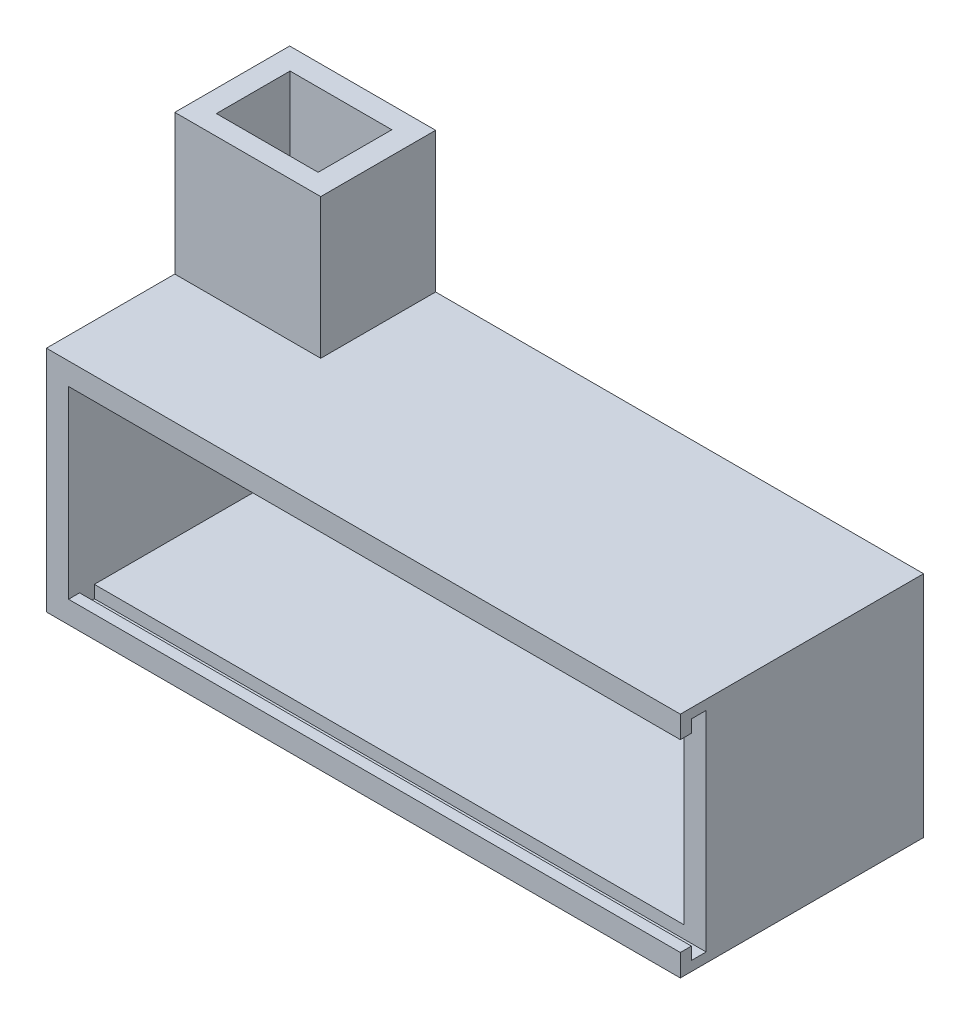
ISO-10303-21;
HEADER;
FILE_DESCRIPTION(('STEP AP214'),'2;1');
FILE_NAME('part.step','',(''),(''),'','','');
FILE_SCHEMA(('AUTOMOTIVE_DESIGN { 1 0 10303 214 1 1 1 1 }'));
ENDSEC;
DATA;
#1=APPLICATION_CONTEXT('core data for automotive mechanical design processes');
#2=APPLICATION_PROTOCOL_DEFINITION('international standard','automotive_design',2000,#1);
#3=PRODUCT_CONTEXT('',#1,'mechanical');
#4=PRODUCT('Part','Part','',(#3));
#5=PRODUCT_RELATED_PRODUCT_CATEGORY('part','',(#4));
#6=PRODUCT_DEFINITION_FORMATION('','',#4);
#7=PRODUCT_DEFINITION_CONTEXT('part definition',#1,'design');
#8=PRODUCT_DEFINITION('design','',#6,#7);
#9=PRODUCT_DEFINITION_SHAPE('','',#8);
#10=(LENGTH_UNIT() NAMED_UNIT(*) SI_UNIT(.MILLI.,.METRE.));
#11=(NAMED_UNIT(*) PLANE_ANGLE_UNIT() SI_UNIT($,.RADIAN.));
#12=(NAMED_UNIT(*) SI_UNIT($,.STERADIAN.) SOLID_ANGLE_UNIT());
#13=UNCERTAINTY_MEASURE_WITH_UNIT(LENGTH_MEASURE(1.E-05),#10,'distance_accuracy_value','');
#14=(GEOMETRIC_REPRESENTATION_CONTEXT(3) GLOBAL_UNCERTAINTY_ASSIGNED_CONTEXT((#13)) GLOBAL_UNIT_ASSIGNED_CONTEXT((#10,
#11,#12)) REPRESENTATION_CONTEXT('',''));
#15=CARTESIAN_POINT('',(0.,0.,0.));
#16=DIRECTION('',(0.,0.,1.));
#17=DIRECTION('',(1.,0.,0.));
#18=AXIS2_PLACEMENT_3D('',#15,#16,#17);
#19=CARTESIAN_POINT('',(0.,28.,28.));
#20=DIRECTION('',(0.,-1.,0.));
#21=DIRECTION('',(1.,0.,0.));
#22=AXIS2_PLACEMENT_3D('',#19,#20,#21);
#23=PLANE('',#22);
#24=DIRECTION('',(0.,0.,-1.));
#25=VECTOR('',#24,1.);
#26=CARTESIAN_POINT('',(-63.1995620838004,28.,15.5864842636624));
#27=LINE('',#26,#25);
#28=CARTESIAN_POINT('',(-63.1995620838004,28.,15.5864842636624));
#29=VERTEX_POINT('',#28);
#30=CARTESIAN_POINT('',(-63.1995620838004,28.,0.));
#31=VERTEX_POINT('',#30);
#32=EDGE_CURVE('E248',#29,#31,#27,.T.);
#33=ORIENTED_EDGE('',*,*,#32,.F.);
#34=DIRECTION('',(1.,0.,0.));
#35=VECTOR('',#34,1.);
#36=CARTESIAN_POINT('',(-83.,28.,15.5864842636624));
#37=LINE('',#36,#35);
#38=CARTESIAN_POINT('',(-83.,28.,15.5864842636624));
#39=VERTEX_POINT('',#38);
#40=EDGE_CURVE('E61',#39,#29,#37,.T.);
#41=ORIENTED_EDGE('',*,*,#40,.F.);
#42=DIRECTION('',(0.,0.,-1.));
#43=VECTOR('',#42,1.);
#44=CARTESIAN_POINT('',(-83.,28.,0.));
#45=LINE('',#44,#43);
#46=CARTESIAN_POINT('',(-83.,28.,33.));
#47=VERTEX_POINT('',#46);
#48=EDGE_CURVE('E354',#47,#39,#45,.T.);
#49=ORIENTED_EDGE('',*,*,#48,.F.);
#50=DIRECTION('',(1.,0.,0.));
#51=VECTOR('',#50,1.);
#52=CARTESIAN_POINT('',(-88.8309518948453,28.,33.));
#53=LINE('',#52,#51);
#54=CARTESIAN_POINT('',(3.,28.,33.));
#55=VERTEX_POINT('',#54);
#56=EDGE_CURVE('E302',#47,#55,#53,.T.);
#57=ORIENTED_EDGE('',*,*,#56,.T.);
#58=DIRECTION('',(0.,0.,1.));
#59=VECTOR('',#58,1.);
#60=CARTESIAN_POINT('',(3.,28.,28.));
#61=LINE('',#60,#59);
#62=CARTESIAN_POINT('',(3.,28.,0.));
#63=VERTEX_POINT('',#62);
#64=EDGE_CURVE('E362',#63,#55,#61,.T.);
#65=ORIENTED_EDGE('',*,*,#64,.F.);
#66=DIRECTION('',(-1.,0.,0.));
#67=VECTOR('',#66,1.);
#68=CARTESIAN_POINT('',(0.,28.,0.));
#69=LINE('',#68,#67);
#70=EDGE_CURVE('E365',#63,#31,#69,.T.);
#71=ORIENTED_EDGE('',*,*,#70,.T.);
#72=EDGE_LOOP('',(#33,#41,#49,#57,#65,#71));
#73=FACE_BOUND('',#72,.T.);
#74=ADVANCED_FACE('F38',(#73),#23,.F.);
#75=CARTESIAN_POINT('',(0.,0.,28.));
#76=DIRECTION('',(0.,1.,0.));
#77=DIRECTION('',(0.,0.,1.));
#78=AXIS2_PLACEMENT_3D('',#75,#76,#77);
#79=PLANE('',#78);
#80=DIRECTION('',(1.,0.,0.));
#81=VECTOR('',#80,1.);
#82=CARTESIAN_POINT('',(-88.8309518948453,0.,29.5));
#83=LINE('',#82,#81);
#84=CARTESIAN_POINT('',(-80.,0.,29.5));
#85=VERTEX_POINT('',#84);
#86=CARTESIAN_POINT('',(0.,0.,29.5));
#87=VERTEX_POINT('',#86);
#88=EDGE_CURVE('E340',#85,#87,#83,.T.);
#89=ORIENTED_EDGE('',*,*,#88,.T.);
#90=DIRECTION('',(0.,0.,-1.));
#91=VECTOR('',#90,1.);
#92=CARTESIAN_POINT('',(0.,0.,28.));
#93=LINE('',#92,#91);
#94=CARTESIAN_POINT('',(0.,0.,4.));
#95=VERTEX_POINT('',#94);
#96=EDGE_CURVE('E376',#87,#95,#93,.T.);
#97=ORIENTED_EDGE('',*,*,#96,.T.);
#98=DIRECTION('',(1.,0.,0.));
#99=VECTOR('',#98,1.);
#100=CARTESIAN_POINT('',(0.,0.,4.));
#101=LINE('',#100,#99);
#102=CARTESIAN_POINT('',(-80.,0.,4.));
#103=VERTEX_POINT('',#102);
#104=EDGE_CURVE('E46',#103,#95,#101,.T.);
#105=ORIENTED_EDGE('',*,*,#104,.F.);
#106=DIRECTION('',(0.,0.,-1.));
#107=VECTOR('',#106,1.);
#108=CARTESIAN_POINT('',(-80.,0.,28.));
#109=LINE('',#108,#107);
#110=EDGE_CURVE('E375',#85,#103,#109,.T.);
#111=ORIENTED_EDGE('',*,*,#110,.F.);
#112=EDGE_LOOP('',(#89,#97,#105,#111));
#113=FACE_BOUND('',#112,.T.);
#114=ADVANCED_FACE('F394',(#113),#79,.T.);
#115=CARTESIAN_POINT('',(0.,25.,28.));
#116=DIRECTION('',(0.,1.,0.));
#117=DIRECTION('',(-1.,0.,0.));
#118=AXIS2_PLACEMENT_3D('',#115,#116,#117);
#119=PLANE('',#118);
#120=DIRECTION('',(1.,0.,0.));
#121=VECTOR('',#120,1.);
#122=CARTESIAN_POINT('',(-80.0315468597901,25.,12.9108154511568));
#123=LINE('',#122,#121);
#124=CARTESIAN_POINT('',(-80.,25.,12.9108154511568));
#125=VERTEX_POINT('',#124);
#126=CARTESIAN_POINT('',(-66.2311089435905,25.,12.9108154511568));
#127=VERTEX_POINT('',#126);
#128=EDGE_CURVE('E214',#125,#127,#123,.T.);
#129=ORIENTED_EDGE('',*,*,#128,.T.);
#130=DIRECTION('',(0.,0.,-1.));
#131=VECTOR('',#130,1.);
#132=CARTESIAN_POINT('',(-66.2311089435905,25.,2.91081545115682));
#133=LINE('',#132,#131);
#134=CARTESIAN_POINT('',(-66.2311089435905,25.,4.));
#135=VERTEX_POINT('',#134);
#136=EDGE_CURVE('E224',#127,#135,#133,.T.);
#137=ORIENTED_EDGE('',*,*,#136,.T.);
#138=DIRECTION('',(-1.,0.,0.));
#139=VECTOR('',#138,1.);
#140=CARTESIAN_POINT('',(0.,25.,4.));
#141=LINE('',#140,#139);
#142=CARTESIAN_POINT('',(0.,25.,4.));
#143=VERTEX_POINT('',#142);
#144=EDGE_CURVE('E383',#143,#135,#141,.T.);
#145=ORIENTED_EDGE('',*,*,#144,.F.);
#146=DIRECTION('',(0.,0.,-1.));
#147=VECTOR('',#146,1.);
#148=CARTESIAN_POINT('',(0.,25.,28.));
#149=LINE('',#148,#147);
#150=CARTESIAN_POINT('',(0.,25.,29.5));
#151=VERTEX_POINT('',#150);
#152=EDGE_CURVE('E367',#151,#143,#149,.T.);
#153=ORIENTED_EDGE('',*,*,#152,.F.);
#154=DIRECTION('',(1.,0.,0.));
#155=VECTOR('',#154,1.);
#156=CARTESIAN_POINT('',(-88.8309518948453,25.,29.5));
#157=LINE('',#156,#155);
#158=CARTESIAN_POINT('',(-80.,25.,29.5));
#159=VERTEX_POINT('',#158);
#160=EDGE_CURVE('E288',#159,#151,#157,.T.);
#161=ORIENTED_EDGE('',*,*,#160,.F.);
#162=DIRECTION('',(0.,0.,-1.));
#163=VECTOR('',#162,1.);
#164=CARTESIAN_POINT('',(-80.,25.,28.));
#165=LINE('',#164,#163);
#166=EDGE_CURVE('E368',#159,#125,#165,.T.);
#167=ORIENTED_EDGE('',*,*,#166,.T.);
#168=EDGE_LOOP('',(#129,#137,#145,#153,#161,#167));
#169=FACE_BOUND('',#168,.T.);
#170=ADVANCED_FACE('F405',(#169),#119,.F.);
#171=DIRECTION('',(1.,0.,0.));
#172=VECTOR('',#171,1.);
#173=CARTESIAN_POINT('',(-88.8309518948453,0.,31.5));
#174=LINE('',#173,#172);
#175=CARTESIAN_POINT('',(-80.,0.,31.5));
#176=VERTEX_POINT('',#175);
#177=CARTESIAN_POINT('',(3.,0.,31.5));
#178=VERTEX_POINT('',#177);
#179=EDGE_CURVE('E329',#176,#178,#174,.T.);
#180=ORIENTED_EDGE('',*,*,#179,.F.);
#181=DIRECTION('',(0.,0.,-1.));
#182=VECTOR('',#181,1.);
#183=CARTESIAN_POINT('',(-80.,0.,33.));
#184=LINE('',#183,#182);
#185=CARTESIAN_POINT('',(-80.,0.,33.));
#186=VERTEX_POINT('',#185);
#187=EDGE_CURVE('E271',#186,#176,#184,.T.);
#188=ORIENTED_EDGE('',*,*,#187,.F.);
#189=DIRECTION('',(1.,0.,0.));
#190=VECTOR('',#189,1.);
#191=CARTESIAN_POINT('',(-88.8309518948453,0.,33.));
#192=LINE('',#191,#190);
#193=CARTESIAN_POINT('',(3.,0.,33.));
#194=VERTEX_POINT('',#193);
#195=EDGE_CURVE('E324',#186,#194,#192,.T.);
#196=ORIENTED_EDGE('',*,*,#195,.T.);
#197=DIRECTION('',(0.,0.,-1.));
#198=VECTOR('',#197,1.);
#199=CARTESIAN_POINT('',(3.,0.,0.));
#200=LINE('',#199,#198);
#201=EDGE_CURVE('E326',#194,#178,#200,.T.);
#202=ORIENTED_EDGE('',*,*,#201,.T.);
#203=EDGE_LOOP('',(#180,#188,#196,#202));
#204=FACE_BOUND('',#203,.T.);
#205=ADVANCED_FACE('F440',(#204),#79,.T.);
#206=DIRECTION('',(0.,0.,1.));
#207=VECTOR('',#206,1.);
#208=CARTESIAN_POINT('',(-80.,25.,33.));
#209=LINE('',#208,#207);
#210=CARTESIAN_POINT('',(-80.,25.,31.5));
#211=VERTEX_POINT('',#210);
#212=CARTESIAN_POINT('',(-80.,25.,33.));
#213=VERTEX_POINT('',#212);
#214=EDGE_CURVE('E270',#211,#213,#209,.T.);
#215=ORIENTED_EDGE('',*,*,#214,.F.);
#216=DIRECTION('',(1.,0.,0.));
#217=VECTOR('',#216,1.);
#218=CARTESIAN_POINT('',(-88.8309518948453,25.,31.5));
#219=LINE('',#218,#217);
#220=CARTESIAN_POINT('',(3.,25.,31.5));
#221=VERTEX_POINT('',#220);
#222=EDGE_CURVE('E308',#211,#221,#219,.T.);
#223=ORIENTED_EDGE('',*,*,#222,.T.);
#224=DIRECTION('',(0.,0.,-1.));
#225=VECTOR('',#224,1.);
#226=CARTESIAN_POINT('',(3.,25.,0.));
#227=LINE('',#226,#225);
#228=CARTESIAN_POINT('',(3.,25.,33.));
#229=VERTEX_POINT('',#228);
#230=EDGE_CURVE('E296',#229,#221,#227,.T.);
#231=ORIENTED_EDGE('',*,*,#230,.F.);
#232=DIRECTION('',(1.,0.,0.));
#233=VECTOR('',#232,1.);
#234=CARTESIAN_POINT('',(-88.8309518948453,25.,33.));
#235=LINE('',#234,#233);
#236=EDGE_CURVE('E310',#213,#229,#235,.T.);
#237=ORIENTED_EDGE('',*,*,#236,.F.);
#238=EDGE_LOOP('',(#215,#223,#231,#237));
#239=FACE_BOUND('',#238,.T.);
#240=ADVANCED_FACE('F430',(#239),#119,.F.);
#241=CARTESIAN_POINT('',(-88.8309518948453,26.6911601611933,0.));
#242=DIRECTION('',(0.,-1.,0.));
#243=DIRECTION('',(1.,0.,0.));
#244=AXIS2_PLACEMENT_3D('',#241,#242,#243);
#245=PLANE('',#244);
#246=DIRECTION('',(1.,0.,0.));
#247=VECTOR('',#246,1.);
#248=CARTESIAN_POINT('',(-88.8309518948453,26.6911601611933,31.5));
#249=LINE('',#248,#247);
#250=CARTESIAN_POINT('',(-80.,26.6911601611933,31.5));
#251=VERTEX_POINT('',#250);
#252=CARTESIAN_POINT('',(3.,26.6911601611933,31.5));
#253=VERTEX_POINT('',#252);
#254=EDGE_CURVE('E306',#251,#253,#249,.T.);
#255=ORIENTED_EDGE('',*,*,#254,.F.);
#256=DIRECTION('',(0.,0.,-1.));
#257=VECTOR('',#256,1.);
#258=CARTESIAN_POINT('',(-80.,26.6911601611933,0.));
#259=LINE('',#258,#257);
#260=CARTESIAN_POINT('',(-80.,26.6911601611933,29.5));
#261=VERTEX_POINT('',#260);
#262=EDGE_CURVE('E282',#251,#261,#259,.T.);
#263=ORIENTED_EDGE('',*,*,#262,.T.);
#264=DIRECTION('',(1.,0.,0.));
#265=VECTOR('',#264,1.);
#266=CARTESIAN_POINT('',(-88.8309518948453,26.6911601611933,29.5));
#267=LINE('',#266,#265);
#268=CARTESIAN_POINT('',(3.,26.6911601611933,29.5));
#269=VERTEX_POINT('',#268);
#270=EDGE_CURVE('E303',#261,#269,#267,.T.);
#271=ORIENTED_EDGE('',*,*,#270,.T.);
#272=DIRECTION('',(0.,0.,-1.));
#273=VECTOR('',#272,1.);
#274=CARTESIAN_POINT('',(3.,26.6911601611933,0.));
#275=LINE('',#274,#273);
#276=EDGE_CURVE('E289',#253,#269,#275,.T.);
#277=ORIENTED_EDGE('',*,*,#276,.F.);
#278=EDGE_LOOP('',(#255,#263,#271,#277));
#279=FACE_BOUND('',#278,.T.);
#280=ADVANCED_FACE('F423',(#279),#245,.T.);
#281=CARTESIAN_POINT('',(-88.8309518948453,25.,31.5));
#282=DIRECTION('',(0.,0.,-1.));
#283=DIRECTION('',(-1.,0.,0.));
#284=AXIS2_PLACEMENT_3D('',#281,#282,#283);
#285=PLANE('',#284);
#286=ORIENTED_EDGE('',*,*,#222,.F.);
#287=DIRECTION('',(0.,1.,0.));
#288=VECTOR('',#287,1.);
#289=CARTESIAN_POINT('',(-80.,25.,31.5));
#290=LINE('',#289,#288);
#291=EDGE_CURVE('E274',#211,#251,#290,.T.);
#292=ORIENTED_EDGE('',*,*,#291,.T.);
#293=ORIENTED_EDGE('',*,*,#254,.T.);
#294=DIRECTION('',(0.,1.,0.));
#295=VECTOR('',#294,1.);
#296=CARTESIAN_POINT('',(3.,25.,31.5));
#297=LINE('',#296,#295);
#298=EDGE_CURVE('E293',#221,#253,#297,.T.);
#299=ORIENTED_EDGE('',*,*,#298,.F.);
#300=EDGE_LOOP('',(#286,#292,#293,#299));
#301=FACE_BOUND('',#300,.T.);
#302=ADVANCED_FACE('F427',(#301),#285,.T.);
#303=CARTESIAN_POINT('',(-88.8309518948453,0.,29.5));
#304=DIRECTION('',(0.,0.,-1.));
#305=DIRECTION('',(-1.,0.,0.));
#306=AXIS2_PLACEMENT_3D('',#303,#304,#305);
#307=PLANE('',#306);
#308=DIRECTION('',(0.,1.,0.));
#309=VECTOR('',#308,1.);
#310=CARTESIAN_POINT('',(-80.,0.,29.5));
#311=LINE('',#310,#309);
#312=CARTESIAN_POINT('',(-80.,-1.69116016119333,29.5));
#313=VERTEX_POINT('',#312);
#314=EDGE_CURVE('E317',#313,#85,#311,.T.);
#315=ORIENTED_EDGE('',*,*,#314,.F.);
#316=DIRECTION('',(1.,0.,0.));
#317=VECTOR('',#316,1.);
#318=CARTESIAN_POINT('',(-88.8309518948453,-1.69116016119333,29.5));
#319=LINE('',#318,#317);
#320=CARTESIAN_POINT('',(3.,-1.69116016119333,29.5));
#321=VERTEX_POINT('',#320);
#322=EDGE_CURVE('E320',#313,#321,#319,.T.);
#323=ORIENTED_EDGE('',*,*,#322,.T.);
#324=DIRECTION('',(0.,1.,0.));
#325=VECTOR('',#324,1.);
#326=CARTESIAN_POINT('',(3.,0.,29.5));
#327=LINE('',#326,#325);
#328=EDGE_CURVE('E338',#321,#269,#327,.T.);
#329=ORIENTED_EDGE('',*,*,#328,.T.);
#330=ORIENTED_EDGE('',*,*,#270,.F.);
#331=DIRECTION('',(0.,-1.,0.));
#332=VECTOR('',#331,1.);
#333=CARTESIAN_POINT('',(-80.,25.,29.5));
#334=LINE('',#333,#332);
#335=EDGE_CURVE('E285',#261,#159,#334,.T.);
#336=ORIENTED_EDGE('',*,*,#335,.T.);
#337=ORIENTED_EDGE('',*,*,#160,.T.);
#338=DIRECTION('',(0.,-1.,0.));
#339=VECTOR('',#338,1.);
#340=CARTESIAN_POINT('',(0.,25.,29.5));
#341=LINE('',#340,#339);
#342=EDGE_CURVE('E267',#151,#87,#341,.T.);
#343=ORIENTED_EDGE('',*,*,#342,.T.);
#344=ORIENTED_EDGE('',*,*,#88,.F.);
#345=EDGE_LOOP('',(#315,#323,#329,#330,#336,#337,#343,#344));
#346=FACE_BOUND('',#345,.T.);
#347=ADVANCED_FACE('F401',(#346),#307,.F.);
#348=CARTESIAN_POINT('',(-88.8309518948453,0.,31.5));
#349=DIRECTION('',(0.,0.,1.));
#350=DIRECTION('',(1.,0.,0.));
#351=AXIS2_PLACEMENT_3D('',#348,#349,#350);
#352=PLANE('',#351);
#353=DIRECTION('',(0.,-1.,0.));
#354=VECTOR('',#353,1.);
#355=CARTESIAN_POINT('',(-80.,0.,31.5));
#356=LINE('',#355,#354);
#357=CARTESIAN_POINT('',(-80.,-1.69116016119333,31.5));
#358=VERTEX_POINT('',#357);
#359=EDGE_CURVE('E292',#176,#358,#356,.T.);
#360=ORIENTED_EDGE('',*,*,#359,.F.);
#361=ORIENTED_EDGE('',*,*,#179,.T.);
#362=DIRECTION('',(0.,-1.,0.));
#363=VECTOR('',#362,1.);
#364=CARTESIAN_POINT('',(3.,0.,31.5));
#365=LINE('',#364,#363);
#366=CARTESIAN_POINT('',(3.,-1.69116016119333,31.5));
#367=VERTEX_POINT('',#366);
#368=EDGE_CURVE('E330',#178,#367,#365,.T.);
#369=ORIENTED_EDGE('',*,*,#368,.T.);
#370=DIRECTION('',(1.,0.,0.));
#371=VECTOR('',#370,1.);
#372=CARTESIAN_POINT('',(-88.8309518948453,-1.69116016119333,31.5));
#373=LINE('',#372,#371);
#374=EDGE_CURVE('E333',#358,#367,#373,.T.);
#375=ORIENTED_EDGE('',*,*,#374,.F.);
#376=EDGE_LOOP('',(#360,#361,#369,#375));
#377=FACE_BOUND('',#376,.T.);
#378=ADVANCED_FACE('F442',(#377),#352,.F.);
#379=CARTESIAN_POINT('',(-88.8309518948453,-1.69116016119333,0.));
#380=DIRECTION('',(0.,-1.,0.));
#381=DIRECTION('',(0.,0.,-1.));
#382=AXIS2_PLACEMENT_3D('',#379,#380,#381);
#383=PLANE('',#382);
#384=DIRECTION('',(0.,0.,-1.));
#385=VECTOR('',#384,1.);
#386=CARTESIAN_POINT('',(-80.,-1.69116016119333,0.));
#387=LINE('',#386,#385);
#388=EDGE_CURVE('E11',#358,#313,#387,.T.);
#389=ORIENTED_EDGE('',*,*,#388,.F.);
#390=ORIENTED_EDGE('',*,*,#374,.T.);
#391=DIRECTION('',(0.,0.,-1.));
#392=VECTOR('',#391,1.);
#393=CARTESIAN_POINT('',(3.,-1.69116016119333,0.));
#394=LINE('',#393,#392);
#395=EDGE_CURVE('E334',#367,#321,#394,.T.);
#396=ORIENTED_EDGE('',*,*,#395,.T.);
#397=ORIENTED_EDGE('',*,*,#322,.F.);
#398=EDGE_LOOP('',(#389,#390,#396,#397));
#399=FACE_BOUND('',#398,.T.);
#400=ADVANCED_FACE('F414',(#399),#383,.F.);
#401=CARTESIAN_POINT('',(0.,0.,4.));
#402=DIRECTION('',(0.,0.,1.));
#403=DIRECTION('',(1.,0.,0.));
#404=AXIS2_PLACEMENT_3D('',#401,#402,#403);
#405=PLANE('',#404);
#406=DIRECTION('',(0.,1.,0.));
#407=VECTOR('',#406,1.);
#408=CARTESIAN_POINT('',(0.,0.,4.));
#409=LINE('',#408,#407);
#410=EDGE_CURVE('E379',#95,#143,#409,.T.);
#411=ORIENTED_EDGE('',*,*,#410,.T.);
#412=ORIENTED_EDGE('',*,*,#144,.T.);
#413=DIRECTION('',(-1.,0.,0.));
#414=VECTOR('',#413,1.);
#415=CARTESIAN_POINT('',(0.,25.,4.));
#416=LINE('',#415,#414);
#417=CARTESIAN_POINT('',(-80.,25.,4.));
#418=VERTEX_POINT('',#417);
#419=EDGE_CURVE('E228',#135,#418,#416,.T.);
#420=ORIENTED_EDGE('',*,*,#419,.T.);
#421=DIRECTION('',(0.,-1.,0.));
#422=VECTOR('',#421,1.);
#423=CARTESIAN_POINT('',(-80.,0.,4.));
#424=LINE('',#423,#422);
#425=EDGE_CURVE('E386',#418,#103,#424,.T.);
#426=ORIENTED_EDGE('',*,*,#425,.T.);
#427=ORIENTED_EDGE('',*,*,#104,.T.);
#428=EDGE_LOOP('',(#411,#412,#420,#426,#427));
#429=FACE_BOUND('',#428,.T.);
#430=ADVANCED_FACE('F391',(#429),#405,.T.);
#431=CARTESIAN_POINT('',(0.,0.,0.));
#432=DIRECTION('',(0.,0.,1.));
#433=DIRECTION('',(1.,0.,0.));
#434=AXIS2_PLACEMENT_3D('',#431,#432,#433);
#435=PLANE('',#434);
#436=ORIENTED_EDGE('',*,*,#70,.F.);
#437=DIRECTION('',(0.,1.,0.));
#438=VECTOR('',#437,1.);
#439=CARTESIAN_POINT('',(3.,28.,0.));
#440=LINE('',#439,#438);
#441=CARTESIAN_POINT('',(3.,-3.,0.));
#442=VERTEX_POINT('',#441);
#443=EDGE_CURVE('E359',#442,#63,#440,.T.);
#444=ORIENTED_EDGE('',*,*,#443,.F.);
#445=DIRECTION('',(-1.,0.,0.));
#446=VECTOR('',#445,1.);
#447=CARTESIAN_POINT('',(0.,-3.,0.));
#448=LINE('',#447,#446);
#449=CARTESIAN_POINT('',(-83.,-3.,0.));
#450=VERTEX_POINT('',#449);
#451=EDGE_CURVE('E371',#442,#450,#448,.T.);
#452=ORIENTED_EDGE('',*,*,#451,.T.);
#453=DIRECTION('',(0.,-1.,0.));
#454=VECTOR('',#453,1.);
#455=CARTESIAN_POINT('',(-83.,28.,0.));
#456=LINE('',#455,#454);
#457=CARTESIAN_POINT('',(-83.,47.,0.));
#458=VERTEX_POINT('',#457);
#459=EDGE_CURVE('E342',#458,#450,#456,.T.);
#460=ORIENTED_EDGE('',*,*,#459,.F.);
#461=DIRECTION('',(-1.,0.,0.));
#462=VECTOR('',#461,1.);
#463=CARTESIAN_POINT('',(-83.,47.,0.));
#464=LINE('',#463,#462);
#465=CARTESIAN_POINT('',(-63.1995620838004,47.,0.));
#466=VERTEX_POINT('',#465);
#467=EDGE_CURVE('E252',#466,#458,#464,.T.);
#468=ORIENTED_EDGE('',*,*,#467,.F.);
#469=DIRECTION('',(0.,-1.,0.));
#470=VECTOR('',#469,1.);
#471=CARTESIAN_POINT('',(-63.1995620838004,47.,0.));
#472=LINE('',#471,#470);
#473=EDGE_CURVE('E255',#466,#31,#472,.T.);
#474=ORIENTED_EDGE('',*,*,#473,.T.);
#475=EDGE_LOOP('',(#436,#444,#452,#460,#468,#474));
#476=FACE_BOUND('',#475,.T.);
#477=ADVANCED_FACE('F40',(#476),#435,.F.);
#478=CARTESIAN_POINT('',(0.,-3.,28.));
#479=DIRECTION('',(0.,-1.,0.));
#480=DIRECTION('',(0.,0.,-1.));
#481=AXIS2_PLACEMENT_3D('',#478,#479,#480);
#482=PLANE('',#481);
#483=DIRECTION('',(1.,0.,0.));
#484=VECTOR('',#483,1.);
#485=CARTESIAN_POINT('',(-88.8309518948453,-3.,33.));
#486=LINE('',#485,#484);
#487=CARTESIAN_POINT('',(-83.,-3.,33.));
#488=VERTEX_POINT('',#487);
#489=CARTESIAN_POINT('',(3.,-3.,33.));
#490=VERTEX_POINT('',#489);
#491=EDGE_CURVE('E325',#488,#490,#486,.T.);
#492=ORIENTED_EDGE('',*,*,#491,.F.);
#493=DIRECTION('',(0.,0.,1.));
#494=VECTOR('',#493,1.);
#495=CARTESIAN_POINT('',(-83.,-3.,0.));
#496=LINE('',#495,#494);
#497=EDGE_CURVE('E352',#450,#488,#496,.T.);
#498=ORIENTED_EDGE('',*,*,#497,.F.);
#499=ORIENTED_EDGE('',*,*,#451,.F.);
#500=DIRECTION('',(0.,0.,-1.));
#501=VECTOR('',#500,1.);
#502=CARTESIAN_POINT('',(3.,-3.,28.));
#503=LINE('',#502,#501);
#504=EDGE_CURVE('E356',#490,#442,#503,.T.);
#505=ORIENTED_EDGE('',*,*,#504,.F.);
#506=EDGE_LOOP('',(#492,#498,#499,#505));
#507=FACE_BOUND('',#506,.T.);
#508=ADVANCED_FACE('F464',(#507),#482,.T.);
#509=CARTESIAN_POINT('',(0.,0.,0.));
#510=DIRECTION('',(1.,0.,0.));
#511=DIRECTION('',(0.,0.,-1.));
#512=AXIS2_PLACEMENT_3D('',#509,#510,#511);
#513=PLANE('',#512);
#514=ORIENTED_EDGE('',*,*,#96,.F.);
#515=ORIENTED_EDGE('',*,*,#342,.F.);
#516=ORIENTED_EDGE('',*,*,#152,.T.);
#517=ORIENTED_EDGE('',*,*,#410,.F.);
#518=EDGE_LOOP('',(#514,#515,#516,#517));
#519=FACE_BOUND('',#518,.T.);
#520=ADVANCED_FACE('F398',(#519),#513,.F.);
#521=CARTESIAN_POINT('',(3.,0.,0.));
#522=DIRECTION('',(1.,0.,0.));
#523=DIRECTION('',(0.,0.,-1.));
#524=AXIS2_PLACEMENT_3D('',#521,#522,#523);
#525=PLANE('',#524);
#526=ORIENTED_EDGE('',*,*,#276,.T.);
#527=ORIENTED_EDGE('',*,*,#328,.F.);
#528=ORIENTED_EDGE('',*,*,#395,.F.);
#529=ORIENTED_EDGE('',*,*,#368,.F.);
#530=ORIENTED_EDGE('',*,*,#201,.F.);
#531=DIRECTION('',(0.,1.,0.));
#532=VECTOR('',#531,1.);
#533=CARTESIAN_POINT('',(3.,0.,33.));
#534=LINE('',#533,#532);
#535=EDGE_CURVE('E321',#490,#194,#534,.T.);
#536=ORIENTED_EDGE('',*,*,#535,.F.);
#537=ORIENTED_EDGE('',*,*,#504,.T.);
#538=ORIENTED_EDGE('',*,*,#443,.T.);
#539=ORIENTED_EDGE('',*,*,#64,.T.);
#540=DIRECTION('',(0.,-1.,0.));
#541=VECTOR('',#540,1.);
#542=CARTESIAN_POINT('',(3.,25.,33.));
#543=LINE('',#542,#541);
#544=EDGE_CURVE('E299',#55,#229,#543,.T.);
#545=ORIENTED_EDGE('',*,*,#544,.T.);
#546=ORIENTED_EDGE('',*,*,#230,.T.);
#547=ORIENTED_EDGE('',*,*,#298,.T.);
#548=EDGE_LOOP('',(#526,#527,#528,#529,#530,#536,#537,#538,#539,#545,#546,#547));
#549=FACE_BOUND('',#548,.T.);
#550=ADVANCED_FACE('F418',(#549),#525,.T.);
#551=CARTESIAN_POINT('',(-80.,0.,0.));
#552=DIRECTION('',(-1.,0.,0.));
#553=DIRECTION('',(0.,0.,1.));
#554=AXIS2_PLACEMENT_3D('',#551,#552,#553);
#555=PLANE('',#554);
#556=ORIENTED_EDGE('',*,*,#166,.F.);
#557=ORIENTED_EDGE('',*,*,#335,.F.);
#558=ORIENTED_EDGE('',*,*,#262,.F.);
#559=ORIENTED_EDGE('',*,*,#291,.F.);
#560=ORIENTED_EDGE('',*,*,#214,.T.);
#561=DIRECTION('',(0.,1.,0.));
#562=VECTOR('',#561,1.);
#563=CARTESIAN_POINT('',(-80.,-5.8309518948453,33.));
#564=LINE('',#563,#562);
#565=EDGE_CURVE('E275',#186,#213,#564,.T.);
#566=ORIENTED_EDGE('',*,*,#565,.F.);
#567=ORIENTED_EDGE('',*,*,#187,.T.);
#568=ORIENTED_EDGE('',*,*,#359,.T.);
#569=ORIENTED_EDGE('',*,*,#388,.T.);
#570=ORIENTED_EDGE('',*,*,#314,.T.);
#571=ORIENTED_EDGE('',*,*,#110,.T.);
#572=ORIENTED_EDGE('',*,*,#425,.F.);
#573=EDGE_CURVE('E372',#125,#418,#165,.T.);
#574=ORIENTED_EDGE('',*,*,#573,.F.);
#575=EDGE_LOOP('',(#556,#557,#558,#559,#560,#566,#567,#568,#569,#570,#571,#572,#574));
#576=FACE_BOUND('',#575,.T.);
#577=ADVANCED_FACE('F410',(#576),#555,.F.);
#578=CARTESIAN_POINT('',(-83.,0.,0.));
#579=DIRECTION('',(-1.,0.,0.));
#580=DIRECTION('',(0.,0.,1.));
#581=AXIS2_PLACEMENT_3D('',#578,#579,#580);
#582=PLANE('',#581);
#583=DIRECTION('',(0.,1.,0.));
#584=VECTOR('',#583,1.);
#585=CARTESIAN_POINT('',(-83.,0.,33.));
#586=LINE('',#585,#584);
#587=EDGE_CURVE('E337',#488,#47,#586,.T.);
#588=ORIENTED_EDGE('',*,*,#587,.T.);
#589=ORIENTED_EDGE('',*,*,#48,.T.);
#590=DIRECTION('',(0.,-1.,0.));
#591=VECTOR('',#590,1.);
#592=CARTESIAN_POINT('',(-83.,47.,15.5864842636624));
#593=LINE('',#592,#591);
#594=CARTESIAN_POINT('',(-83.,47.,15.5864842636624));
#595=VERTEX_POINT('',#594);
#596=EDGE_CURVE('E264',#595,#39,#593,.T.);
#597=ORIENTED_EDGE('',*,*,#596,.F.);
#598=DIRECTION('',(0.,0.,1.));
#599=VECTOR('',#598,1.);
#600=CARTESIAN_POINT('',(-83.,47.,15.5864842636624));
#601=LINE('',#600,#599);
#602=EDGE_CURVE('E244',#458,#595,#601,.T.);
#603=ORIENTED_EDGE('',*,*,#602,.F.);
#604=ORIENTED_EDGE('',*,*,#459,.T.);
#605=ORIENTED_EDGE('',*,*,#497,.T.);
#606=EDGE_LOOP('',(#588,#589,#597,#603,#604,#605));
#607=FACE_BOUND('',#606,.T.);
#608=ADVANCED_FACE('F461',(#607),#582,.T.);
#609=CARTESIAN_POINT('',(-88.8309518948453,0.,33.));
#610=DIRECTION('',(0.,0.,-1.));
#611=DIRECTION('',(-1.,0.,0.));
#612=AXIS2_PLACEMENT_3D('',#609,#610,#611);
#613=PLANE('',#612);
#614=ORIENTED_EDGE('',*,*,#491,.T.);
#615=ORIENTED_EDGE('',*,*,#535,.T.);
#616=ORIENTED_EDGE('',*,*,#195,.F.);
#617=ORIENTED_EDGE('',*,*,#565,.T.);
#618=ORIENTED_EDGE('',*,*,#236,.T.);
#619=ORIENTED_EDGE('',*,*,#544,.F.);
#620=ORIENTED_EDGE('',*,*,#56,.F.);
#621=ORIENTED_EDGE('',*,*,#587,.F.);
#622=EDGE_LOOP('',(#614,#615,#616,#617,#618,#619,#620,#621));
#623=FACE_BOUND('',#622,.T.);
#624=ADVANCED_FACE('F434',(#623),#613,.F.);
#625=CARTESIAN_POINT('',(0.,47.,0.));
#626=DIRECTION('',(0.,-1.,0.));
#627=DIRECTION('',(1.,0.,0.));
#628=AXIS2_PLACEMENT_3D('',#625,#626,#627);
#629=PLANE('',#628);
#630=ORIENTED_EDGE('',*,*,#602,.T.);
#631=DIRECTION('',(1.,0.,0.));
#632=VECTOR('',#631,1.);
#633=CARTESIAN_POINT('',(-83.,47.,15.5864842636624));
#634=LINE('',#633,#632);
#635=CARTESIAN_POINT('',(-63.1995620838004,47.,15.5864842636624));
#636=VERTEX_POINT('',#635);
#637=EDGE_CURVE('E247',#595,#636,#634,.T.);
#638=ORIENTED_EDGE('',*,*,#637,.T.);
#639=DIRECTION('',(0.,0.,-1.));
#640=VECTOR('',#639,1.);
#641=CARTESIAN_POINT('',(-63.1995620838004,47.,15.5864842636624));
#642=LINE('',#641,#640);
#643=EDGE_CURVE('E250',#636,#466,#642,.T.);
#644=ORIENTED_EDGE('',*,*,#643,.T.);
#645=ORIENTED_EDGE('',*,*,#467,.T.);
#646=EDGE_LOOP('',(#630,#638,#644,#645));
#647=FACE_BOUND('',#646,.T.);
#648=DIRECTION('',(0.,0.,1.));
#649=VECTOR('',#648,1.);
#650=CARTESIAN_POINT('',(-80.0315468597901,47.,2.91081545115682));
#651=LINE('',#650,#649);
#652=CARTESIAN_POINT('',(-80.0315468597901,47.,2.91081545115682));
#653=VERTEX_POINT('',#652);
#654=CARTESIAN_POINT('',(-80.0315468597901,47.,12.9108154511568));
#655=VERTEX_POINT('',#654);
#656=EDGE_CURVE('E207',#653,#655,#651,.T.);
#657=ORIENTED_EDGE('',*,*,#656,.F.);
#658=DIRECTION('',(-1.,0.,0.));
#659=VECTOR('',#658,1.);
#660=CARTESIAN_POINT('',(-80.0315468597901,47.,2.91081545115682));
#661=LINE('',#660,#659);
#662=CARTESIAN_POINT('',(-66.2311089435905,47.,2.91081545115682));
#663=VERTEX_POINT('',#662);
#664=EDGE_CURVE('E237',#663,#653,#661,.T.);
#665=ORIENTED_EDGE('',*,*,#664,.F.);
#666=DIRECTION('',(0.,0.,-1.));
#667=VECTOR('',#666,1.);
#668=CARTESIAN_POINT('',(-66.2311089435905,47.,2.91081545115682));
#669=LINE('',#668,#667);
#670=CARTESIAN_POINT('',(-66.2311089435905,47.,12.9108154511568));
#671=VERTEX_POINT('',#670);
#672=EDGE_CURVE('E234',#671,#663,#669,.T.);
#673=ORIENTED_EDGE('',*,*,#672,.F.);
#674=DIRECTION('',(1.,0.,0.));
#675=VECTOR('',#674,1.);
#676=CARTESIAN_POINT('',(-80.0315468597901,47.,12.9108154511568));
#677=LINE('',#676,#675);
#678=EDGE_CURVE('E232',#655,#671,#677,.T.);
#679=ORIENTED_EDGE('',*,*,#678,.F.);
#680=EDGE_LOOP('',(#657,#665,#673,#679));
#681=FACE_BOUND('',#680,.T.);
#682=ADVANCED_FACE('F466',(#647,#681),#629,.F.);
#683=CARTESIAN_POINT('',(-83.,47.,15.5864842636624));
#684=DIRECTION('',(0.,0.,-1.));
#685=DIRECTION('',(-1.,0.,0.));
#686=AXIS2_PLACEMENT_3D('',#683,#684,#685);
#687=PLANE('',#686);
#688=ORIENTED_EDGE('',*,*,#40,.T.);
#689=DIRECTION('',(0.,-1.,0.));
#690=VECTOR('',#689,1.);
#691=CARTESIAN_POINT('',(-63.1995620838004,47.,15.5864842636624));
#692=LINE('',#691,#690);
#693=EDGE_CURVE('E261',#636,#29,#692,.T.);
#694=ORIENTED_EDGE('',*,*,#693,.F.);
#695=ORIENTED_EDGE('',*,*,#637,.F.);
#696=ORIENTED_EDGE('',*,*,#596,.T.);
#697=EDGE_LOOP('',(#688,#694,#695,#696));
#698=FACE_BOUND('',#697,.T.);
#699=ADVANCED_FACE('F457',(#698),#687,.F.);
#700=CARTESIAN_POINT('',(-63.1995620838004,47.,15.5864842636624));
#701=DIRECTION('',(-1.,0.,0.));
#702=DIRECTION('',(0.,-1.,0.));
#703=AXIS2_PLACEMENT_3D('',#700,#701,#702);
#704=PLANE('',#703);
#705=ORIENTED_EDGE('',*,*,#32,.T.);
#706=ORIENTED_EDGE('',*,*,#473,.F.);
#707=ORIENTED_EDGE('',*,*,#643,.F.);
#708=ORIENTED_EDGE('',*,*,#693,.T.);
#709=EDGE_LOOP('',(#705,#706,#707,#708));
#710=FACE_BOUND('',#709,.T.);
#711=ADVANCED_FACE('F453',(#710),#704,.F.);
#712=CARTESIAN_POINT('',(-80.0315468597901,47.,2.91081545115682));
#713=DIRECTION('',(1.,0.,0.));
#714=DIRECTION('',(0.,1.,0.));
#715=AXIS2_PLACEMENT_3D('',#712,#713,#714);
#716=PLANE('',#715);
#717=DIRECTION('',(0.,-1.,0.));
#718=VECTOR('',#717,1.);
#719=CARTESIAN_POINT('',(-80.0315468597901,47.,12.9108154511568));
#720=LINE('',#719,#718);
#721=CARTESIAN_POINT('',(-80.0315468597901,25.,12.9108154511568));
#722=VERTEX_POINT('',#721);
#723=EDGE_CURVE('E201',#655,#722,#720,.T.);
#724=ORIENTED_EDGE('',*,*,#723,.T.);
#725=DIRECTION('',(0.,0.,1.));
#726=VECTOR('',#725,1.);
#727=CARTESIAN_POINT('',(-80.0315468597901,25.,2.91081545115682));
#728=LINE('',#727,#726);
#729=CARTESIAN_POINT('',(-80.0315468597901,25.,2.91081545115682));
#730=VERTEX_POINT('',#729);
#731=EDGE_CURVE('E204',#730,#722,#728,.T.);
#732=ORIENTED_EDGE('',*,*,#731,.F.);
#733=DIRECTION('',(0.,-1.,0.));
#734=VECTOR('',#733,1.);
#735=CARTESIAN_POINT('',(-80.0315468597901,47.,2.91081545115682));
#736=LINE('',#735,#734);
#737=EDGE_CURVE('E239',#653,#730,#736,.T.);
#738=ORIENTED_EDGE('',*,*,#737,.F.);
#739=ORIENTED_EDGE('',*,*,#656,.T.);
#740=EDGE_LOOP('',(#724,#732,#738,#739));
#741=FACE_BOUND('',#740,.T.);
#742=ADVANCED_FACE('F202',(#741),#716,.T.);
#743=CARTESIAN_POINT('',(-80.0315468597901,47.,12.9108154511568));
#744=DIRECTION('',(0.,0.,-1.));
#745=DIRECTION('',(-1.,0.,0.));
#746=AXIS2_PLACEMENT_3D('',#743,#744,#745);
#747=PLANE('',#746);
#748=DIRECTION('',(0.,-1.,0.));
#749=VECTOR('',#748,1.);
#750=CARTESIAN_POINT('',(-66.2311089435905,47.,12.9108154511568));
#751=LINE('',#750,#749);
#752=EDGE_CURVE('E210',#671,#127,#751,.T.);
#753=ORIENTED_EDGE('',*,*,#752,.T.);
#754=ORIENTED_EDGE('',*,*,#128,.F.);
#755=EDGE_CURVE('E53',#722,#125,#123,.T.);
#756=ORIENTED_EDGE('',*,*,#755,.F.);
#757=ORIENTED_EDGE('',*,*,#723,.F.);
#758=ORIENTED_EDGE('',*,*,#678,.T.);
#759=EDGE_LOOP('',(#753,#754,#756,#757,#758));
#760=FACE_BOUND('',#759,.T.);
#761=ADVANCED_FACE('F212',(#760),#747,.T.);
#762=CARTESIAN_POINT('',(-66.2311089435905,47.,2.91081545115682));
#763=DIRECTION('',(-1.,0.,0.));
#764=DIRECTION('',(0.,-1.,0.));
#765=AXIS2_PLACEMENT_3D('',#762,#763,#764);
#766=PLANE('',#765);
#767=DIRECTION('',(0.,-1.,0.));
#768=VECTOR('',#767,1.);
#769=CARTESIAN_POINT('',(-66.2311089435905,47.,2.91081545115682));
#770=LINE('',#769,#768);
#771=CARTESIAN_POINT('',(-66.2311089435905,25.,2.91081545115682));
#772=VERTEX_POINT('',#771);
#773=EDGE_CURVE('E241',#663,#772,#770,.T.);
#774=ORIENTED_EDGE('',*,*,#773,.T.);
#775=EDGE_CURVE('E216',#135,#772,#133,.T.);
#776=ORIENTED_EDGE('',*,*,#775,.F.);
#777=ORIENTED_EDGE('',*,*,#136,.F.);
#778=ORIENTED_EDGE('',*,*,#752,.F.);
#779=ORIENTED_EDGE('',*,*,#672,.T.);
#780=EDGE_LOOP('',(#774,#776,#777,#778,#779));
#781=FACE_BOUND('',#780,.T.);
#782=ADVANCED_FACE('F474',(#781),#766,.T.);
#783=CARTESIAN_POINT('',(-80.0315468597901,47.,2.91081545115682));
#784=DIRECTION('',(0.,0.,1.));
#785=DIRECTION('',(1.,0.,0.));
#786=AXIS2_PLACEMENT_3D('',#783,#784,#785);
#787=PLANE('',#786);
#788=ORIENTED_EDGE('',*,*,#737,.T.);
#789=DIRECTION('',(-1.,0.,0.));
#790=VECTOR('',#789,1.);
#791=CARTESIAN_POINT('',(-80.0315468597901,25.,2.91081545115682));
#792=LINE('',#791,#790);
#793=EDGE_CURVE('E221',#772,#730,#792,.T.);
#794=ORIENTED_EDGE('',*,*,#793,.F.);
#795=ORIENTED_EDGE('',*,*,#773,.F.);
#796=ORIENTED_EDGE('',*,*,#664,.T.);
#797=EDGE_LOOP('',(#788,#794,#795,#796));
#798=FACE_BOUND('',#797,.T.);
#799=ADVANCED_FACE('F476',(#798),#787,.T.);
#800=CARTESIAN_POINT('',(0.,25.,0.));
#801=DIRECTION('',(0.,1.,0.));
#802=DIRECTION('',(-1.,0.,0.));
#803=AXIS2_PLACEMENT_3D('',#800,#801,#802);
#804=PLANE('',#803);
#805=ORIENTED_EDGE('',*,*,#775,.T.);
#806=ORIENTED_EDGE('',*,*,#793,.T.);
#807=ORIENTED_EDGE('',*,*,#731,.T.);
#808=ORIENTED_EDGE('',*,*,#755,.T.);
#809=ORIENTED_EDGE('',*,*,#573,.T.);
#810=ORIENTED_EDGE('',*,*,#419,.F.);
#811=EDGE_LOOP('',(#805,#806,#807,#808,#809,#810));
#812=FACE_BOUND('',#811,.T.);
#813=ADVANCED_FACE('F219',(#812),#804,.T.);
#814=CLOSED_SHELL('',(#74,#114,#170,#205,#240,#280,#302,#347,#378,#400,#430,#477,#508,#520,#550,
#577,#608,#624,#682,#699,#711,#742,#761,#782,#799,#813));
#815=MANIFOLD_SOLID_BREP('B2',#814);
#816=ADVANCED_BREP_SHAPE_REPRESENTATION('',(#18,#815),#14);
#817=SHAPE_DEFINITION_REPRESENTATION(#9,#816);
ENDSEC;
END-ISO-10303-21;
